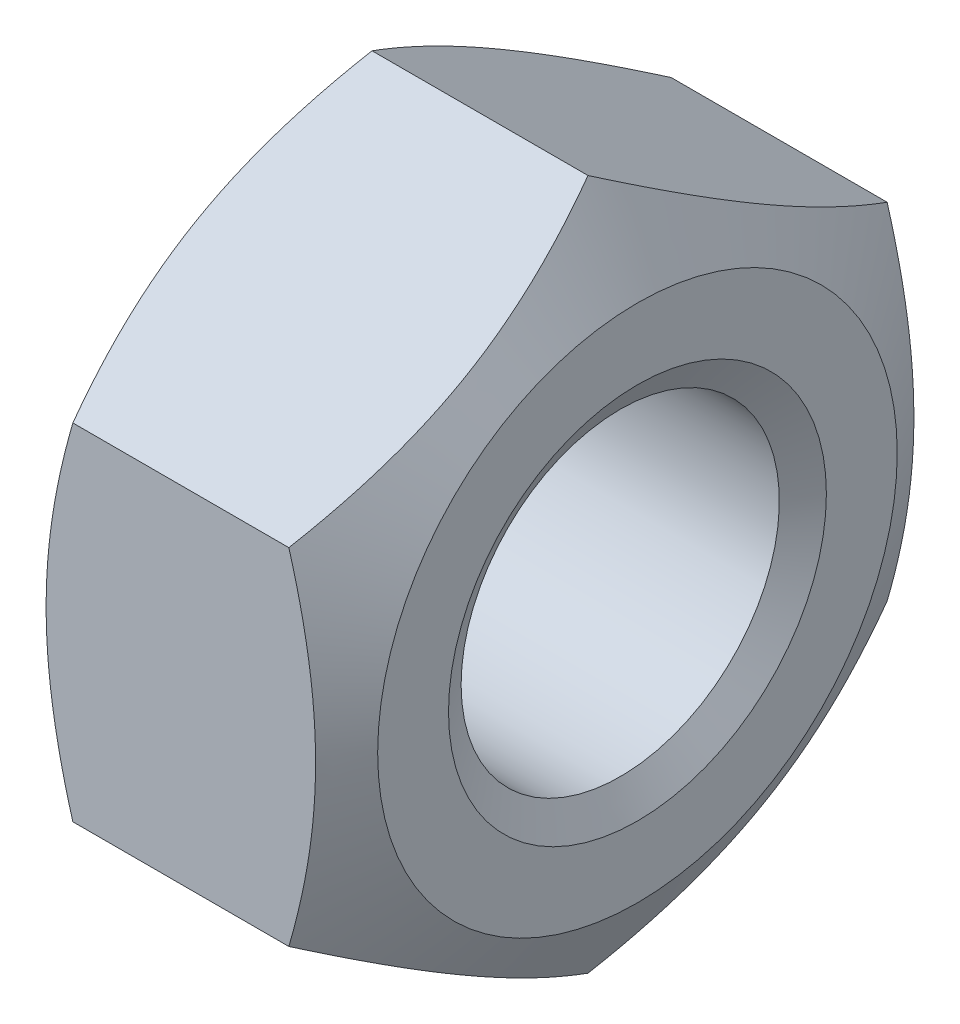
ISO-10303-21;
HEADER;
FILE_DESCRIPTION(('STEP AP214'),'2;1');
FILE_NAME('part.step','',(''),(''),'','','');
FILE_SCHEMA(('AUTOMOTIVE_DESIGN { 1 0 10303 214 1 1 1 1 }'));
ENDSEC;
DATA;
#1=APPLICATION_CONTEXT('core data for automotive mechanical design processes');
#2=APPLICATION_PROTOCOL_DEFINITION('international standard','automotive_design',2000,#1);
#3=PRODUCT_CONTEXT('',#1,'mechanical');
#4=PRODUCT('Part','Part','',(#3));
#5=PRODUCT_RELATED_PRODUCT_CATEGORY('part','',(#4));
#6=PRODUCT_DEFINITION_FORMATION('','',#4);
#7=PRODUCT_DEFINITION_CONTEXT('part definition',#1,'design');
#8=PRODUCT_DEFINITION('design','',#6,#7);
#9=PRODUCT_DEFINITION_SHAPE('','',#8);
#10=(LENGTH_UNIT() NAMED_UNIT(*) SI_UNIT(.MILLI.,.METRE.));
#11=(NAMED_UNIT(*) PLANE_ANGLE_UNIT() SI_UNIT($,.RADIAN.));
#12=(NAMED_UNIT(*) SI_UNIT($,.STERADIAN.) SOLID_ANGLE_UNIT());
#13=UNCERTAINTY_MEASURE_WITH_UNIT(LENGTH_MEASURE(1.E-05),#10,'distance_accuracy_value','');
#14=(GEOMETRIC_REPRESENTATION_CONTEXT(3) GLOBAL_UNCERTAINTY_ASSIGNED_CONTEXT((#13)) GLOBAL_UNIT_ASSIGNED_CONTEXT((#10,
#11,#12)) REPRESENTATION_CONTEXT('',''));
#15=CARTESIAN_POINT('',(0.,0.,0.));
#16=DIRECTION('',(0.,0.,1.));
#17=DIRECTION('',(1.,0.,0.));
#18=AXIS2_PLACEMENT_3D('',#15,#16,#17);
#19=CARTESIAN_POINT('',(0.2734375,0.,0.));
#20=DIRECTION('',(-1.,0.,0.));
#21=DIRECTION('',(0.,0.,1.));
#22=AXIS2_PLACEMENT_3D('',#19,#20,#21);
#23=CONICAL_SURFACE('',#22,5.52660764269462,1.0471975511966);
#24=CARTESIAN_POINT('',(0.546875,0.,0.));
#25=DIRECTION('',(1.,0.,0.));
#26=DIRECTION('',(0.,1.,0.));
#27=AXIS2_PLACEMENT_3D('',#24,#25,#26);
#28=CIRCLE('',#27,5.053);
#29=CARTESIAN_POINT('',(0.546875,5.053,0.));
#30=VERTEX_POINT('',#29);
#31=EDGE_CURVE('E10',#30,#30,#28,.T.);
#32=ORIENTED_EDGE('',*,*,#31,.T.);
#33=EDGE_LOOP('',(#32));
#34=FACE_BOUND('',#33,.T.);
#35=CARTESIAN_POINT('',(0.,0.,0.));
#36=DIRECTION('',(-1.,0.,0.));
#37=DIRECTION('',(0.,0.,1.));
#38=AXIS2_PLACEMENT_3D('',#35,#36,#37);
#39=CIRCLE('',#38,6.00021528538923);
#40=CARTESIAN_POINT('',(0.,0.,6.00021528538923));
#41=VERTEX_POINT('',#40);
#42=EDGE_CURVE('E26',#41,#41,#39,.T.);
#43=ORIENTED_EDGE('',*,*,#42,.T.);
#44=EDGE_LOOP('',(#43));
#45=FACE_BOUND('',#44,.T.);
#46=ADVANCED_FACE('F16',(#34,#45),#23,.F.);
#47=CARTESIAN_POINT('',(-20.706019161965,0.,0.));
#48=DIRECTION('',(1.,0.,0.));
#49=DIRECTION('',(0.,1.,0.));
#50=AXIS2_PLACEMENT_3D('',#47,#48,#49);
#51=CYLINDRICAL_SURFACE('',#50,5.053);
#52=CARTESIAN_POINT('',(9.453125,0.,0.));
#53=DIRECTION('',(-1.,0.,0.));
#54=DIRECTION('',(0.,0.,1.));
#55=AXIS2_PLACEMENT_3D('',#52,#53,#54);
#56=CIRCLE('',#55,5.053);
#57=CARTESIAN_POINT('',(9.453125,0.,5.053));
#58=VERTEX_POINT('',#57);
#59=EDGE_CURVE('E191',#58,#58,#56,.T.);
#60=ORIENTED_EDGE('',*,*,#59,.F.);
#61=EDGE_LOOP('',(#60));
#62=FACE_BOUND('',#61,.T.);
#63=ORIENTED_EDGE('',*,*,#31,.F.);
#64=EDGE_LOOP('',(#63));
#65=FACE_BOUND('',#64,.T.);
#66=ADVANCED_FACE('F204',(#62,#65),#51,.F.);
#67=CARTESIAN_POINT('',(0.,0.,0.));
#68=DIRECTION('',(1.,0.,0.));
#69=DIRECTION('',(0.,0.,-1.));
#70=AXIS2_PLACEMENT_3D('',#67,#68,#69);
#71=PLANE('',#70);
#72=CARTESIAN_POINT('',(0.,0.,0.));
#73=DIRECTION('',(-1.,0.,0.));
#74=DIRECTION('',(0.,0.,1.));
#75=AXIS2_PLACEMENT_3D('',#72,#73,#74);
#76=CIRCLE('',#75,8.25);
#77=CARTESIAN_POINT('',(0.,0.,8.25));
#78=VERTEX_POINT('',#77);
#79=EDGE_CURVE('E192',#78,#78,#76,.T.);
#80=ORIENTED_EDGE('',*,*,#79,.T.);
#81=EDGE_LOOP('',(#80));
#82=FACE_BOUND('',#81,.T.);
#83=ORIENTED_EDGE('',*,*,#42,.F.);
#84=EDGE_LOOP('',(#83));
#85=FACE_BOUND('',#84,.T.);
#86=ADVANCED_FACE('F201',(#82,#85),#71,.F.);
#87=CARTESIAN_POINT('',(9.7265625,0.,0.));
#88=DIRECTION('',(1.,0.,0.));
#89=DIRECTION('',(0.,1.,0.));
#90=AXIS2_PLACEMENT_3D('',#87,#88,#89);
#91=CONICAL_SURFACE('',#90,5.52660764269462,1.0471975511966);
#92=ORIENTED_EDGE('',*,*,#59,.T.);
#93=EDGE_LOOP('',(#92));
#94=FACE_BOUND('',#93,.T.);
#95=CARTESIAN_POINT('',(10.,0.,0.));
#96=DIRECTION('',(1.,0.,0.));
#97=DIRECTION('',(0.,1.,0.));
#98=AXIS2_PLACEMENT_3D('',#95,#96,#97);
#99=CIRCLE('',#98,6.00021528538923);
#100=CARTESIAN_POINT('',(10.,6.00021528538923,0.));
#101=VERTEX_POINT('',#100);
#102=EDGE_CURVE('E188',#101,#101,#99,.T.);
#103=ORIENTED_EDGE('',*,*,#102,.T.);
#104=EDGE_LOOP('',(#103));
#105=FACE_BOUND('',#104,.T.);
#106=ADVANCED_FACE('F203',(#94,#105),#91,.F.);
#107=CARTESIAN_POINT('',(10.,0.,0.));
#108=DIRECTION('',(1.,0.,0.));
#109=DIRECTION('',(0.,0.,-1.));
#110=AXIS2_PLACEMENT_3D('',#107,#108,#109);
#111=PLANE('',#110);
#112=CARTESIAN_POINT('',(10.,0.,0.));
#113=DIRECTION('',(1.,0.,0.));
#114=DIRECTION('',(0.,1.,0.));
#115=AXIS2_PLACEMENT_3D('',#112,#113,#114);
#116=CIRCLE('',#115,8.25);
#117=CARTESIAN_POINT('',(10.,8.25,0.));
#118=VERTEX_POINT('',#117);
#119=EDGE_CURVE('E171',#118,#118,#116,.T.);
#120=ORIENTED_EDGE('',*,*,#119,.T.);
#121=EDGE_LOOP('',(#120));
#122=FACE_BOUND('',#121,.T.);
#123=ORIENTED_EDGE('',*,*,#102,.F.);
#124=EDGE_LOOP('',(#123));
#125=FACE_BOUND('',#124,.T.);
#126=ADVANCED_FACE('F212',(#122,#125),#111,.T.);
#127=CARTESIAN_POINT('',(0.78509680625946,0.,0.));
#128=DIRECTION('',(1.,0.,0.));
#129=DIRECTION('',(0.,0.,1.));
#130=AXIS2_PLACEMENT_3D('',#127,#128,#129);
#131=CONICAL_SURFACE('',#130,9.60982755730144,1.0471975511966);
#132=CARTESIAN_POINT('',(1.57019361251892,5.48482755730145,9.5));
#133=CARTESIAN_POINT('',(-0.0131397208144157,0.,9.5));
#134=CARTESIAN_POINT('',(1.57019361251892,-5.48482755730145,9.5));
#135=(BOUNDED_CURVE() B_SPLINE_CURVE(2,(#132,#133,#134),.UNSPECIFIED.,.F.,
.F.) B_SPLINE_CURVE_WITH_KNOTS((3,3),(0.,1.11001433117402),
.UNSPECIFIED.) CURVE() GEOMETRIC_REPRESENTATION_ITEM() RATIONAL_B_SPLINE_CURVE((1.,
1.15470053837925,1.)) REPRESENTATION_ITEM(''));
#136=CARTESIAN_POINT('',(1.57019361251892,5.48482755730145,9.5));
#137=VERTEX_POINT('',#136);
#138=CARTESIAN_POINT('',(1.57019361251892,-5.48482755730145,9.5));
#139=VERTEX_POINT('',#138);
#140=EDGE_CURVE('E35',#137,#139,#135,.T.);
#141=ORIENTED_EDGE('',*,*,#140,.F.);
#142=CARTESIAN_POINT('',(1.57019361251892,10.9696551146029,0.));
#143=CARTESIAN_POINT('',(-0.0131397208144127,8.22724133595217,4.75000000000001));
#144=CARTESIAN_POINT('',(1.57019361251892,5.48482755730144,9.50000000000001));
#145=(BOUNDED_CURVE() B_SPLINE_CURVE(2,(#142,#143,#144),.UNSPECIFIED.,.F.,
.F.) B_SPLINE_CURVE_WITH_KNOTS((3,3),(0.,1.11001433117402),
.UNSPECIFIED.) CURVE() GEOMETRIC_REPRESENTATION_ITEM() RATIONAL_B_SPLINE_CURVE((1.,
1.15470053837925,1.)) REPRESENTATION_ITEM(''));
#146=CARTESIAN_POINT('',(1.57019361251892,10.9696551146029,0.));
#147=VERTEX_POINT('',#146);
#148=EDGE_CURVE('E80',#147,#137,#145,.T.);
#149=ORIENTED_EDGE('',*,*,#148,.F.);
#150=CARTESIAN_POINT('',(1.57019361251892,5.48482755730148,-9.49999999999998));
#151=CARTESIAN_POINT('',(-0.0131397208144032,8.22724133595218,-4.74999999999999));
#152=CARTESIAN_POINT('',(1.57019361251892,10.9696551146029,0.));
#153=(BOUNDED_CURVE() B_SPLINE_CURVE(2,(#150,#151,#152),.UNSPECIFIED.,.F.,
.F.) B_SPLINE_CURVE_WITH_KNOTS((3,3),(0.,1.11001433117402),
.UNSPECIFIED.) CURVE() GEOMETRIC_REPRESENTATION_ITEM() RATIONAL_B_SPLINE_CURVE((1.,
1.15470053837925,1.)) REPRESENTATION_ITEM(''));
#154=CARTESIAN_POINT('',(1.57019361251892,5.48482755730148,-9.49999999999998));
#155=VERTEX_POINT('',#154);
#156=EDGE_CURVE('E164',#155,#147,#153,.T.);
#157=ORIENTED_EDGE('',*,*,#156,.F.);
#158=CARTESIAN_POINT('',(1.57019361251892,-5.4848275573014,-9.50000000000003));
#159=CARTESIAN_POINT('',(-0.0131397208143996,0.,-9.50000000000001));
#160=CARTESIAN_POINT('',(1.57019361251892,5.48482755730145,-9.5));
#161=(BOUNDED_CURVE() B_SPLINE_CURVE(2,(#158,#159,#160),.UNSPECIFIED.,.F.,
.F.) B_SPLINE_CURVE_WITH_KNOTS((3,3),(0.,1.11001433117402),
.UNSPECIFIED.) CURVE() GEOMETRIC_REPRESENTATION_ITEM() RATIONAL_B_SPLINE_CURVE((1.,
1.15470053837925,1.)) REPRESENTATION_ITEM(''));
#162=CARTESIAN_POINT('',(1.57019361251892,-5.4848275573014,-9.50000000000003));
#163=VERTEX_POINT('',#162);
#164=EDGE_CURVE('E88',#163,#155,#161,.T.);
#165=ORIENTED_EDGE('',*,*,#164,.F.);
#166=CARTESIAN_POINT('',(1.57019361251892,-10.9696551146029,0.));
#167=CARTESIAN_POINT('',(-0.0131397208144171,-8.22724133595216,-4.75000000000001));
#168=CARTESIAN_POINT('',(1.57019361251892,-5.48482755730143,-9.50000000000001));
#169=(BOUNDED_CURVE() B_SPLINE_CURVE(2,(#166,#167,#168),.UNSPECIFIED.,.F.,
.F.) B_SPLINE_CURVE_WITH_KNOTS((3,3),(0.,1.11001433117402),
.UNSPECIFIED.) CURVE() GEOMETRIC_REPRESENTATION_ITEM() RATIONAL_B_SPLINE_CURVE((1.,
1.15470053837925,1.)) REPRESENTATION_ITEM(''));
#170=CARTESIAN_POINT('',(1.57019361251892,-10.9696551146029,0.));
#171=VERTEX_POINT('',#170);
#172=EDGE_CURVE('E99',#171,#163,#169,.T.);
#173=ORIENTED_EDGE('',*,*,#172,.F.);
#174=CARTESIAN_POINT('',(1.57019361251892,-5.48482755730145,9.5));
#175=CARTESIAN_POINT('',(-0.0131397208144127,-8.22724133595217,4.75));
#176=CARTESIAN_POINT('',(1.57019361251892,-10.9696551146029,0.));
#177=(BOUNDED_CURVE() B_SPLINE_CURVE(2,(#174,#175,#176),.UNSPECIFIED.,.F.,
.F.) B_SPLINE_CURVE_WITH_KNOTS((3,3),(0.,1.11001433117402),
.UNSPECIFIED.) CURVE() GEOMETRIC_REPRESENTATION_ITEM() RATIONAL_B_SPLINE_CURVE((1.,
1.15470053837925,1.)) REPRESENTATION_ITEM(''));
#178=EDGE_CURVE('E132',#139,#171,#177,.T.);
#179=ORIENTED_EDGE('',*,*,#178,.F.);
#180=EDGE_LOOP('',(#141,#149,#157,#165,#173,#179));
#181=FACE_BOUND('',#180,.T.);
#182=ORIENTED_EDGE('',*,*,#79,.F.);
#183=EDGE_LOOP('',(#182));
#184=FACE_BOUND('',#183,.T.);
#185=ADVANCED_FACE('F224',(#181,#184),#131,.T.);
#186=CARTESIAN_POINT('',(9.21490319374054,0.,0.));
#187=DIRECTION('',(-1.,0.,0.));
#188=DIRECTION('',(0.,0.,1.));
#189=AXIS2_PLACEMENT_3D('',#186,#187,#188);
#190=CONICAL_SURFACE('',#189,9.60982755730144,1.0471975511966);
#191=CARTESIAN_POINT('',(8.42980638748108,5.48482755730144,9.50000000000001));
#192=CARTESIAN_POINT('',(10.0131397208144,8.22724133595216,4.75000000000001));
#193=CARTESIAN_POINT('',(8.42980638748108,10.9696551146029,0.));
#194=(BOUNDED_CURVE() B_SPLINE_CURVE(2,(#191,#192,#193),.UNSPECIFIED.,.F.,
.F.) B_SPLINE_CURVE_WITH_KNOTS((3,3),(0.,1.11001433117402),
.UNSPECIFIED.) CURVE() GEOMETRIC_REPRESENTATION_ITEM() RATIONAL_B_SPLINE_CURVE((1.,
1.15470053837925,1.)) REPRESENTATION_ITEM(''));
#195=CARTESIAN_POINT('',(8.42980638748108,5.48482755730145,9.5));
#196=VERTEX_POINT('',#195);
#197=CARTESIAN_POINT('',(8.42980638748108,10.9696551146029,0.));
#198=VERTEX_POINT('',#197);
#199=EDGE_CURVE('E102',#196,#198,#194,.T.);
#200=ORIENTED_EDGE('',*,*,#199,.F.);
#201=CARTESIAN_POINT('',(8.42980638748108,-5.48482755730145,9.5));
#202=CARTESIAN_POINT('',(10.0131397208144,0.,9.5));
#203=CARTESIAN_POINT('',(8.42980638748108,5.48482755730145,9.5));
#204=(BOUNDED_CURVE() B_SPLINE_CURVE(2,(#201,#202,#203),.UNSPECIFIED.,.F.,
.F.) B_SPLINE_CURVE_WITH_KNOTS((3,3),(0.,1.11001433117402),
.UNSPECIFIED.) CURVE() GEOMETRIC_REPRESENTATION_ITEM() RATIONAL_B_SPLINE_CURVE((1.,
1.15470053837925,1.)) REPRESENTATION_ITEM(''));
#205=CARTESIAN_POINT('',(8.42980638748108,-5.48482755730145,9.5));
#206=VERTEX_POINT('',#205);
#207=EDGE_CURVE('E105',#206,#196,#204,.T.);
#208=ORIENTED_EDGE('',*,*,#207,.F.);
#209=CARTESIAN_POINT('',(8.42980638748108,-10.9696551146029,0.));
#210=CARTESIAN_POINT('',(10.0131397208144,-8.22724133595217,4.75));
#211=CARTESIAN_POINT('',(8.42980638748108,-5.48482755730145,9.5));
#212=(BOUNDED_CURVE() B_SPLINE_CURVE(2,(#209,#210,#211),.UNSPECIFIED.,.F.,
.F.) B_SPLINE_CURVE_WITH_KNOTS((3,3),(0.,1.11001433117402),
.UNSPECIFIED.) CURVE() GEOMETRIC_REPRESENTATION_ITEM() RATIONAL_B_SPLINE_CURVE((1.,
1.15470053837925,1.)) REPRESENTATION_ITEM(''));
#213=CARTESIAN_POINT('',(8.42980638748108,-10.9696551146029,0.));
#214=VERTEX_POINT('',#213);
#215=EDGE_CURVE('E120',#214,#206,#212,.T.);
#216=ORIENTED_EDGE('',*,*,#215,.F.);
#217=CARTESIAN_POINT('',(8.42980638748108,-5.48482755730143,-9.50000000000001));
#218=CARTESIAN_POINT('',(10.0131397208144,-8.22724133595216,-4.75000000000001));
#219=CARTESIAN_POINT('',(8.42980638748108,-10.9696551146029,0.));
#220=(BOUNDED_CURVE() B_SPLINE_CURVE(2,(#217,#218,#219),.UNSPECIFIED.,.F.,
.F.) B_SPLINE_CURVE_WITH_KNOTS((3,3),(0.,1.11001433117402),
.UNSPECIFIED.) CURVE() GEOMETRIC_REPRESENTATION_ITEM() RATIONAL_B_SPLINE_CURVE((1.,
1.15470053837925,1.)) REPRESENTATION_ITEM(''));
#221=CARTESIAN_POINT('',(8.42980638748108,-5.4848275573014,-9.50000000000003));
#222=VERTEX_POINT('',#221);
#223=EDGE_CURVE('E66',#222,#214,#220,.T.);
#224=ORIENTED_EDGE('',*,*,#223,.F.);
#225=CARTESIAN_POINT('',(8.42980638748108,5.48482755730145,-9.5));
#226=CARTESIAN_POINT('',(10.0131397208144,0.,-9.50000000000001));
#227=CARTESIAN_POINT('',(8.42980638748108,-5.4848275573014,-9.50000000000003));
#228=(BOUNDED_CURVE() B_SPLINE_CURVE(2,(#225,#226,#227),.UNSPECIFIED.,.F.,
.F.) B_SPLINE_CURVE_WITH_KNOTS((3,3),(0.,1.11001433117402),
.UNSPECIFIED.) CURVE() GEOMETRIC_REPRESENTATION_ITEM() RATIONAL_B_SPLINE_CURVE((1.,
1.15470053837925,1.)) REPRESENTATION_ITEM(''));
#229=CARTESIAN_POINT('',(8.42980638748108,5.48482755730148,-9.49999999999998));
#230=VERTEX_POINT('',#229);
#231=EDGE_CURVE('E69',#230,#222,#228,.T.);
#232=ORIENTED_EDGE('',*,*,#231,.F.);
#233=CARTESIAN_POINT('',(8.42980638748108,10.9696551146029,0.));
#234=CARTESIAN_POINT('',(10.0131397208144,8.22724133595218,-4.74999999999999));
#235=CARTESIAN_POINT('',(8.42980638748108,5.48482755730147,-9.49999999999998));
#236=(BOUNDED_CURVE() B_SPLINE_CURVE(2,(#233,#234,#235),.UNSPECIFIED.,.F.,
.F.) B_SPLINE_CURVE_WITH_KNOTS((3,3),(0.,1.11001433117402),
.UNSPECIFIED.) CURVE() GEOMETRIC_REPRESENTATION_ITEM() RATIONAL_B_SPLINE_CURVE((1.,
1.15470053837925,1.)) REPRESENTATION_ITEM(''));
#237=EDGE_CURVE('E73',#198,#230,#236,.T.);
#238=ORIENTED_EDGE('',*,*,#237,.F.);
#239=EDGE_LOOP('',(#200,#208,#216,#224,#232,#238));
#240=FACE_BOUND('',#239,.T.);
#241=ORIENTED_EDGE('',*,*,#119,.F.);
#242=EDGE_LOOP('',(#241));
#243=FACE_BOUND('',#242,.T.);
#244=ADVANCED_FACE('F18',(#240,#243),#190,.T.);
#245=CARTESIAN_POINT('',(0.,10.9696551146029,0.));
#246=DIRECTION('',(0.,0.866025403784439,-0.499999999999999));
#247=DIRECTION('',(0.,0.499999999999999,0.866025403784439));
#248=AXIS2_PLACEMENT_3D('',#245,#246,#247);
#249=PLANE('',#248);
#250=ORIENTED_EDGE('',*,*,#156,.T.);
#251=DIRECTION('',(1.,0.,0.));
#252=VECTOR('',#251,1.);
#253=CARTESIAN_POINT('',(0.,10.9696551146029,0.));
#254=LINE('',#253,#252);
#255=EDGE_CURVE('E87',#147,#198,#254,.T.);
#256=ORIENTED_EDGE('',*,*,#255,.T.);
#257=ORIENTED_EDGE('',*,*,#237,.T.);
#258=DIRECTION('',(1.,0.,0.));
#259=VECTOR('',#258,1.);
#260=CARTESIAN_POINT('',(0.,5.48482755730146,-9.5));
#261=LINE('',#260,#259);
#262=EDGE_CURVE('E79',#155,#230,#261,.T.);
#263=ORIENTED_EDGE('',*,*,#262,.F.);
#264=EDGE_LOOP('',(#250,#256,#257,#263));
#265=FACE_BOUND('',#264,.T.);
#266=ADVANCED_FACE('F85',(#265),#249,.T.);
#267=CARTESIAN_POINT('',(0.,5.48482755730146,-9.5));
#268=DIRECTION('',(0.,0.,-1.));
#269=DIRECTION('',(0.,1.,0.));
#270=AXIS2_PLACEMENT_3D('',#267,#268,#269);
#271=PLANE('',#270);
#272=ORIENTED_EDGE('',*,*,#164,.T.);
#273=ORIENTED_EDGE('',*,*,#262,.T.);
#274=ORIENTED_EDGE('',*,*,#231,.T.);
#275=DIRECTION('',(1.,0.,0.));
#276=VECTOR('',#275,1.);
#277=CARTESIAN_POINT('',(0.,-5.48482755730142,-9.50000000000003));
#278=LINE('',#277,#276);
#279=EDGE_CURVE('E97',#163,#222,#278,.T.);
#280=ORIENTED_EDGE('',*,*,#279,.F.);
#281=EDGE_LOOP('',(#272,#273,#274,#280));
#282=FACE_BOUND('',#281,.T.);
#283=ADVANCED_FACE('F90',(#282),#271,.T.);
#284=CARTESIAN_POINT('',(0.,5.48482755730144,9.5));
#285=DIRECTION('',(0.,0.866025403784438,0.500000000000001));
#286=DIRECTION('',(0.,-0.500000000000001,0.866025403784438));
#287=AXIS2_PLACEMENT_3D('',#284,#285,#286);
#288=PLANE('',#287);
#289=ORIENTED_EDGE('',*,*,#148,.T.);
#290=DIRECTION('',(1.,0.,0.));
#291=VECTOR('',#290,1.);
#292=CARTESIAN_POINT('',(0.,5.48482755730144,9.5));
#293=LINE('',#292,#291);
#294=EDGE_CURVE('E100',#137,#196,#293,.T.);
#295=ORIENTED_EDGE('',*,*,#294,.T.);
#296=ORIENTED_EDGE('',*,*,#199,.T.);
#297=ORIENTED_EDGE('',*,*,#255,.F.);
#298=EDGE_LOOP('',(#289,#295,#296,#297));
#299=FACE_BOUND('',#298,.T.);
#300=ADVANCED_FACE('F241',(#299),#288,.T.);
#301=CARTESIAN_POINT('',(0.,-5.48482755730145,9.5));
#302=DIRECTION('',(0.,0.,1.));
#303=DIRECTION('',(1.,0.,0.));
#304=AXIS2_PLACEMENT_3D('',#301,#302,#303);
#305=PLANE('',#304);
#306=ORIENTED_EDGE('',*,*,#140,.T.);
#307=DIRECTION('',(1.,0.,0.));
#308=VECTOR('',#307,1.);
#309=CARTESIAN_POINT('',(0.,-5.48482755730145,9.5));
#310=LINE('',#309,#308);
#311=EDGE_CURVE('E103',#139,#206,#310,.T.);
#312=ORIENTED_EDGE('',*,*,#311,.T.);
#313=ORIENTED_EDGE('',*,*,#207,.T.);
#314=ORIENTED_EDGE('',*,*,#294,.F.);
#315=EDGE_LOOP('',(#306,#312,#313,#314));
#316=FACE_BOUND('',#315,.T.);
#317=ADVANCED_FACE('F244',(#316),#305,.T.);
#318=CARTESIAN_POINT('',(0.,-5.48482755730142,-9.50000000000003));
#319=DIRECTION('',(0.,-0.866025403784438,-0.500000000000001));
#320=DIRECTION('',(0.,0.500000000000001,-0.866025403784438));
#321=AXIS2_PLACEMENT_3D('',#318,#319,#320);
#322=PLANE('',#321);
#323=ORIENTED_EDGE('',*,*,#172,.T.);
#324=ORIENTED_EDGE('',*,*,#279,.T.);
#325=ORIENTED_EDGE('',*,*,#223,.T.);
#326=DIRECTION('',(1.,0.,0.));
#327=VECTOR('',#326,1.);
#328=CARTESIAN_POINT('',(0.,-10.9696551146029,0.));
#329=LINE('',#328,#327);
#330=EDGE_CURVE('E20',#171,#214,#329,.T.);
#331=ORIENTED_EDGE('',*,*,#330,.F.);
#332=EDGE_LOOP('',(#323,#324,#325,#331));
#333=FACE_BOUND('',#332,.T.);
#334=ADVANCED_FACE('F248',(#333),#322,.T.);
#335=CARTESIAN_POINT('',(0.,-10.9696551146029,0.));
#336=DIRECTION('',(0.,-0.866025403784439,0.5));
#337=DIRECTION('',(0.,-0.5,-0.866025403784439));
#338=AXIS2_PLACEMENT_3D('',#335,#336,#337);
#339=PLANE('',#338);
#340=ORIENTED_EDGE('',*,*,#178,.T.);
#341=ORIENTED_EDGE('',*,*,#330,.T.);
#342=ORIENTED_EDGE('',*,*,#215,.T.);
#343=ORIENTED_EDGE('',*,*,#311,.F.);
#344=EDGE_LOOP('',(#340,#341,#342,#343));
#345=FACE_BOUND('',#344,.T.);
#346=ADVANCED_FACE('F250',(#345),#339,.T.);
#347=CLOSED_SHELL('',(#46,#66,#86,#106,#126,#185,#244,#266,#283,#300,#317,#334,#346));
#348=MANIFOLD_SOLID_BREP('B1',#347);
#349=ADVANCED_BREP_SHAPE_REPRESENTATION('',(#18,#348),#14);
#350=SHAPE_DEFINITION_REPRESENTATION(#9,#349);
ENDSEC;
END-ISO-10303-21;
